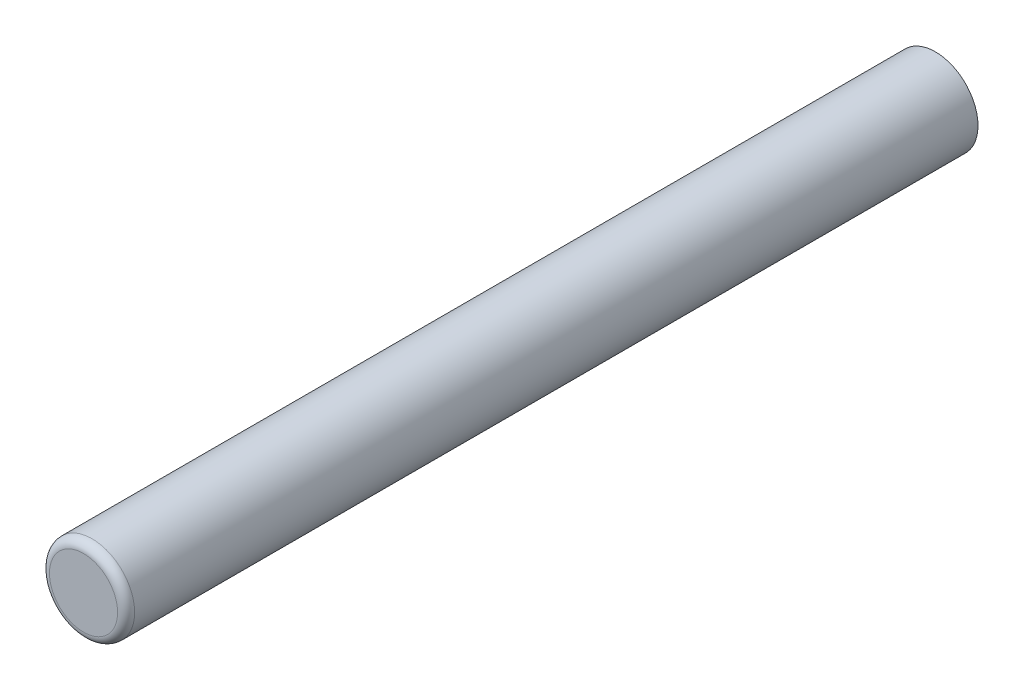
ISO-10303-21;
HEADER;
FILE_DESCRIPTION(('STEP AP214'),'2;1');
FILE_NAME('part.step','',(''),(''),'','','');
FILE_SCHEMA(('AUTOMOTIVE_DESIGN { 1 0 10303 214 1 1 1 1 }'));
ENDSEC;
DATA;
#1=APPLICATION_CONTEXT('core data for automotive mechanical design processes');
#2=APPLICATION_PROTOCOL_DEFINITION('international standard','automotive_design',2000,#1);
#3=PRODUCT_CONTEXT('',#1,'mechanical');
#4=PRODUCT('Part','Part','',(#3));
#5=PRODUCT_RELATED_PRODUCT_CATEGORY('part','',(#4));
#6=PRODUCT_DEFINITION_FORMATION('','',#4);
#7=PRODUCT_DEFINITION_CONTEXT('part definition',#1,'design');
#8=PRODUCT_DEFINITION('design','',#6,#7);
#9=PRODUCT_DEFINITION_SHAPE('','',#8);
#10=(LENGTH_UNIT() NAMED_UNIT(*) SI_UNIT(.MILLI.,.METRE.));
#11=(NAMED_UNIT(*) PLANE_ANGLE_UNIT() SI_UNIT($,.RADIAN.));
#12=(NAMED_UNIT(*) SI_UNIT($,.STERADIAN.) SOLID_ANGLE_UNIT());
#13=UNCERTAINTY_MEASURE_WITH_UNIT(LENGTH_MEASURE(1.E-05),#10,'distance_accuracy_value','');
#14=(GEOMETRIC_REPRESENTATION_CONTEXT(3) GLOBAL_UNCERTAINTY_ASSIGNED_CONTEXT((#13)) GLOBAL_UNIT_ASSIGNED_CONTEXT((#10,
#11,#12)) REPRESENTATION_CONTEXT('',''));
#15=CARTESIAN_POINT('',(0.,0.,0.));
#16=DIRECTION('',(0.,0.,1.));
#17=DIRECTION('',(1.,0.,0.));
#18=AXIS2_PLACEMENT_3D('',#15,#16,#17);
#19=CARTESIAN_POINT('',(0.,0.,63.5));
#20=DIRECTION('',(0.,0.,-1.));
#21=DIRECTION('',(-1.,0.,0.));
#22=AXIS2_PLACEMENT_3D('',#19,#20,#21);
#23=CYLINDRICAL_SURFACE('',#22,3.175);
#24=CARTESIAN_POINT('',(0.,0.,62.865));
#25=DIRECTION('',(0.,0.,1.));
#26=DIRECTION('',(1.,0.,0.));
#27=AXIS2_PLACEMENT_3D('',#24,#25,#26);
#28=CIRCLE('',#27,3.175);
#29=CARTESIAN_POINT('',(3.175,0.,62.865));
#30=VERTEX_POINT('',#29);
#31=EDGE_CURVE('E10',#30,#30,#28,.F.);
#32=ORIENTED_EDGE('',*,*,#31,.T.);
#33=EDGE_LOOP('',(#32));
#34=FACE_BOUND('',#33,.T.);
#35=CARTESIAN_POINT('',(0.,0.,0.));
#36=DIRECTION('',(0.,0.,1.));
#37=DIRECTION('',(1.,0.,0.));
#38=AXIS2_PLACEMENT_3D('',#35,#36,#37);
#39=CIRCLE('',#38,3.175);
#40=CARTESIAN_POINT('',(3.175,0.,0.));
#41=VERTEX_POINT('',#40);
#42=EDGE_CURVE('E46',#41,#41,#39,.T.);
#43=ORIENTED_EDGE('',*,*,#42,.T.);
#44=EDGE_LOOP('',(#43));
#45=FACE_BOUND('',#44,.T.);
#46=ADVANCED_FACE('F32',(#34,#45),#23,.T.);
#47=CARTESIAN_POINT('',(0.,0.,63.5));
#48=DIRECTION('',(0.,0.,1.));
#49=DIRECTION('',(1.,0.,0.));
#50=AXIS2_PLACEMENT_3D('',#47,#48,#49);
#51=PLANE('',#50);
#52=CARTESIAN_POINT('',(0.,0.,63.5));
#53=DIRECTION('',(0.,0.,1.));
#54=DIRECTION('',(1.,0.,0.));
#55=AXIS2_PLACEMENT_3D('',#52,#53,#54);
#56=CIRCLE('',#55,2.54);
#57=CARTESIAN_POINT('',(2.54,0.,63.5));
#58=VERTEX_POINT('',#57);
#59=EDGE_CURVE('E40',#58,#58,#56,.T.);
#60=ORIENTED_EDGE('',*,*,#59,.T.);
#61=EDGE_LOOP('',(#60));
#62=FACE_BOUND('',#61,.T.);
#63=ADVANCED_FACE('F56',(#62),#51,.T.);
#64=CARTESIAN_POINT('',(0.,0.,0.));
#65=DIRECTION('',(0.,0.,1.));
#66=DIRECTION('',(1.,0.,0.));
#67=AXIS2_PLACEMENT_3D('',#64,#65,#66);
#68=PLANE('',#67);
#69=ORIENTED_EDGE('',*,*,#42,.F.);
#70=EDGE_LOOP('',(#69));
#71=FACE_BOUND('',#70,.T.);
#72=ADVANCED_FACE('F54',(#71),#68,.F.);
#73=CARTESIAN_POINT('',(0.,0.,62.865));
#74=DIRECTION('',(0.,0.,1.));
#75=DIRECTION('',(1.,0.,0.));
#76=AXIS2_PLACEMENT_3D('',#73,#74,#75);
#77=TOROIDAL_SURFACE('',#76,2.54,0.635);
#78=ORIENTED_EDGE('',*,*,#31,.F.);
#79=EDGE_LOOP('',(#78));
#80=FACE_BOUND('',#79,.T.);
#81=ORIENTED_EDGE('',*,*,#59,.F.);
#82=EDGE_LOOP('',(#81));
#83=FACE_BOUND('',#82,.T.);
#84=ADVANCED_FACE('F34',(#80,#83),#77,.T.);
#85=CLOSED_SHELL('',(#46,#63,#72,#84));
#86=MANIFOLD_SOLID_BREP('B2',#85);
#87=ADVANCED_BREP_SHAPE_REPRESENTATION('',(#18,#86),#14);
#88=SHAPE_DEFINITION_REPRESENTATION(#9,#87);
ENDSEC;
END-ISO-10303-21;
